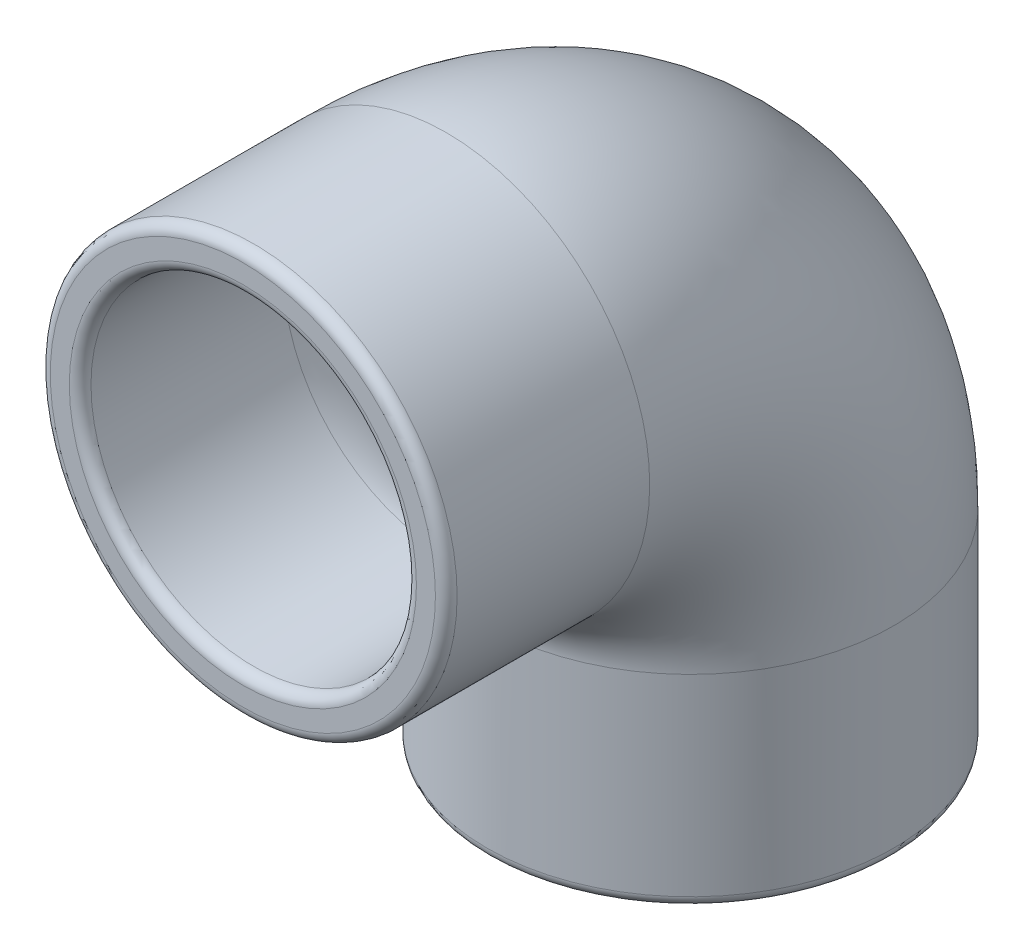
ISO-10303-21;
HEADER;
FILE_DESCRIPTION(('STEP AP214'),'2;1');
FILE_NAME('part.step','',(''),(''),'','','');
FILE_SCHEMA(('AUTOMOTIVE_DESIGN { 1 0 10303 214 1 1 1 1 }'));
ENDSEC;
DATA;
#1=APPLICATION_CONTEXT('core data for automotive mechanical design processes');
#2=APPLICATION_PROTOCOL_DEFINITION('international standard','automotive_design',2000,#1);
#3=PRODUCT_CONTEXT('',#1,'mechanical');
#4=PRODUCT('Part','Part','',(#3));
#5=PRODUCT_RELATED_PRODUCT_CATEGORY('part','',(#4));
#6=PRODUCT_DEFINITION_FORMATION('','',#4);
#7=PRODUCT_DEFINITION_CONTEXT('part definition',#1,'design');
#8=PRODUCT_DEFINITION('design','',#6,#7);
#9=PRODUCT_DEFINITION_SHAPE('','',#8);
#10=(LENGTH_UNIT() NAMED_UNIT(*) SI_UNIT(.MILLI.,.METRE.));
#11=(NAMED_UNIT(*) PLANE_ANGLE_UNIT() SI_UNIT($,.RADIAN.));
#12=(NAMED_UNIT(*) SI_UNIT($,.STERADIAN.) SOLID_ANGLE_UNIT());
#13=UNCERTAINTY_MEASURE_WITH_UNIT(LENGTH_MEASURE(1.E-05),#10,'distance_accuracy_value','');
#14=(GEOMETRIC_REPRESENTATION_CONTEXT(3) GLOBAL_UNCERTAINTY_ASSIGNED_CONTEXT((#13)) GLOBAL_UNIT_ASSIGNED_CONTEXT((#10,
#11,#12)) REPRESENTATION_CONTEXT('',''));
#15=CARTESIAN_POINT('',(0.,0.,0.));
#16=DIRECTION('',(0.,0.,1.));
#17=DIRECTION('',(1.,0.,0.));
#18=AXIS2_PLACEMENT_3D('',#15,#16,#17);
#19=CARTESIAN_POINT('',(0.,-18.,-33.));
#20=DIRECTION('',(0.,-1.,0.));
#21=DIRECTION('',(0.,0.,-1.));
#22=AXIS2_PLACEMENT_3D('',#19,#20,#21);
#23=CYLINDRICAL_SURFACE('',#22,15.);
#24=CARTESIAN_POINT('',(0.,-32.2,-33.));
#25=DIRECTION('',(0.,1.,0.));
#26=DIRECTION('',(0.,0.,1.));
#27=AXIS2_PLACEMENT_3D('',#24,#25,#26);
#28=CIRCLE('',#27,15.);
#29=CARTESIAN_POINT('',(0.,-32.2,-18.));
#30=VERTEX_POINT('',#29);
#31=EDGE_CURVE('E47',#30,#30,#28,.T.);
#32=ORIENTED_EDGE('',*,*,#31,.T.);
#33=EDGE_LOOP('',(#32));
#34=FACE_BOUND('',#33,.T.);
#35=CARTESIAN_POINT('',(0.,-18.,-33.));
#36=DIRECTION('',(0.,1.,0.));
#37=DIRECTION('',(1.,0.,0.));
#38=AXIS2_PLACEMENT_3D('',#35,#36,#37);
#39=CIRCLE('',#38,15.);
#40=CARTESIAN_POINT('',(0.,-18.,-48.));
#41=VERTEX_POINT('',#40);
#42=EDGE_CURVE('E64',#41,#41,#39,.T.);
#43=ORIENTED_EDGE('',*,*,#42,.F.);
#44=EDGE_LOOP('',(#43));
#45=FACE_BOUND('',#44,.T.);
#46=ADVANCED_FACE('F32',(#34,#45),#23,.T.);
#47=CARTESIAN_POINT('',(0.,-18.,-33.));
#48=DIRECTION('',(0.,-1.,0.));
#49=DIRECTION('',(0.,0.,-1.));
#50=AXIS2_PLACEMENT_3D('',#47,#48,#49);
#51=CYLINDRICAL_SURFACE('',#50,12.);
#52=CARTESIAN_POINT('',(0.,-32.2,-33.));
#53=DIRECTION('',(0.,1.,0.));
#54=DIRECTION('',(0.,0.,1.));
#55=AXIS2_PLACEMENT_3D('',#52,#53,#54);
#56=CIRCLE('',#55,12.);
#57=CARTESIAN_POINT('',(0.,-32.2,-21.));
#58=VERTEX_POINT('',#57);
#59=EDGE_CURVE('E10',#58,#58,#56,.F.);
#60=ORIENTED_EDGE('',*,*,#59,.T.);
#61=EDGE_LOOP('',(#60));
#62=FACE_BOUND('',#61,.T.);
#63=CARTESIAN_POINT('',(0.,-18.,-33.));
#64=DIRECTION('',(0.,1.,0.));
#65=DIRECTION('',(1.,0.,0.));
#66=AXIS2_PLACEMENT_3D('',#63,#64,#65);
#67=CIRCLE('',#66,12.);
#68=CARTESIAN_POINT('',(0.,-18.,-45.));
#69=VERTEX_POINT('',#68);
#70=EDGE_CURVE('E67',#69,#69,#67,.T.);
#71=ORIENTED_EDGE('',*,*,#70,.T.);
#72=EDGE_LOOP('',(#71));
#73=FACE_BOUND('',#72,.T.);
#74=ADVANCED_FACE('F95',(#62,#73),#51,.F.);
#75=CARTESIAN_POINT('',(0.,-18.,-15.));
#76=DIRECTION('',(-1.,0.,0.));
#77=DIRECTION('',(0.,0.,1.));
#78=AXIS2_PLACEMENT_3D('',#75,#76,#77);
#79=TOROIDAL_SURFACE('',#78,18.,15.);
#80=CARTESIAN_POINT('',(0.,0.,-15.));
#81=DIRECTION('',(0.,0.,1.));
#82=DIRECTION('',(1.,0.,0.));
#83=AXIS2_PLACEMENT_3D('',#80,#81,#82);
#84=CIRCLE('',#83,15.);
#85=CARTESIAN_POINT('',(0.,15.,-15.));
#86=VERTEX_POINT('',#85);
#87=EDGE_CURVE('E70',#86,#86,#84,.T.);
#88=CARTESIAN_POINT('',(0.,-18.,-15.));
#89=DIRECTION('',(-1.,0.,0.));
#90=DIRECTION('',(0.,0.,1.));
#91=AXIS2_PLACEMENT_3D('',#88,#89,#90);
#92=CIRCLE('',#91,33.);
#93=EDGE_CURVE('',#86,#41,#92,.T.);
#94=ORIENTED_EDGE('',*,*,#87,.F.);
#95=ORIENTED_EDGE('',*,*,#42,.T.);
#96=ORIENTED_EDGE('',*,*,#93,.T.);
#97=ORIENTED_EDGE('',*,*,#93,.F.);
#98=EDGE_LOOP('',(#94,#96,#95,#97));
#99=FACE_BOUND('',#98,.T.);
#100=ADVANCED_FACE('F92',(#99),#79,.T.);
#101=CARTESIAN_POINT('',(0.,-18.,-15.));
#102=DIRECTION('',(-1.,0.,0.));
#103=DIRECTION('',(0.,0.,1.));
#104=AXIS2_PLACEMENT_3D('',#101,#102,#103);
#105=TOROIDAL_SURFACE('',#104,18.,12.);
#106=CARTESIAN_POINT('',(0.,0.,-15.));
#107=DIRECTION('',(0.,0.,1.));
#108=DIRECTION('',(1.,0.,0.));
#109=AXIS2_PLACEMENT_3D('',#106,#107,#108);
#110=CIRCLE('',#109,12.);
#111=CARTESIAN_POINT('',(0.,12.,-15.));
#112=VERTEX_POINT('',#111);
#113=EDGE_CURVE('E73',#112,#112,#110,.T.);
#114=CARTESIAN_POINT('',(0.,-18.,-15.));
#115=DIRECTION('',(-1.,0.,0.));
#116=DIRECTION('',(0.,0.,1.));
#117=AXIS2_PLACEMENT_3D('',#114,#115,#116);
#118=CIRCLE('',#117,30.);
#119=EDGE_CURVE('',#112,#69,#118,.T.);
#120=ORIENTED_EDGE('',*,*,#113,.T.);
#121=ORIENTED_EDGE('',*,*,#70,.F.);
#122=ORIENTED_EDGE('',*,*,#119,.T.);
#123=ORIENTED_EDGE('',*,*,#119,.F.);
#124=EDGE_LOOP('',(#120,#122,#121,#123));
#125=FACE_BOUND('',#124,.T.);
#126=ADVANCED_FACE('F77',(#125),#105,.F.);
#127=CARTESIAN_POINT('',(0.,0.,-15.));
#128=DIRECTION('',(0.,0.,1.));
#129=DIRECTION('',(1.,0.,0.));
#130=AXIS2_PLACEMENT_3D('',#127,#128,#129);
#131=CYLINDRICAL_SURFACE('',#130,12.);
#132=CARTESIAN_POINT('',(0.,0.,-0.8));
#133=DIRECTION('',(0.,0.,1.));
#134=DIRECTION('',(1.,0.,0.));
#135=AXIS2_PLACEMENT_3D('',#132,#133,#134);
#136=CIRCLE('',#135,12.);
#137=CARTESIAN_POINT('',(12.,0.,-0.8));
#138=VERTEX_POINT('',#137);
#139=EDGE_CURVE('E52',#138,#138,#136,.T.);
#140=ORIENTED_EDGE('',*,*,#139,.T.);
#141=EDGE_LOOP('',(#140));
#142=FACE_BOUND('',#141,.T.);
#143=ORIENTED_EDGE('',*,*,#113,.F.);
#144=EDGE_LOOP('',(#143));
#145=FACE_BOUND('',#144,.T.);
#146=ADVANCED_FACE('F80',(#142,#145),#131,.F.);
#147=CARTESIAN_POINT('',(0.,0.,-15.));
#148=DIRECTION('',(0.,0.,1.));
#149=DIRECTION('',(1.,0.,0.));
#150=AXIS2_PLACEMENT_3D('',#147,#148,#149);
#151=CYLINDRICAL_SURFACE('',#150,15.);
#152=CARTESIAN_POINT('',(0.,0.,-0.8));
#153=DIRECTION('',(0.,0.,1.));
#154=DIRECTION('',(1.,0.,0.));
#155=AXIS2_PLACEMENT_3D('',#152,#153,#154);
#156=CIRCLE('',#155,15.);
#157=CARTESIAN_POINT('',(15.,0.,-0.8));
#158=VERTEX_POINT('',#157);
#159=EDGE_CURVE('E55',#158,#158,#156,.F.);
#160=ORIENTED_EDGE('',*,*,#159,.T.);
#161=EDGE_LOOP('',(#160));
#162=FACE_BOUND('',#161,.T.);
#163=ORIENTED_EDGE('',*,*,#87,.T.);
#164=EDGE_LOOP('',(#163));
#165=FACE_BOUND('',#164,.T.);
#166=ADVANCED_FACE('F82',(#162,#165),#151,.T.);
#167=CARTESIAN_POINT('',(0.,-33.,-33.));
#168=DIRECTION('',(0.,1.,0.));
#169=DIRECTION('',(1.,0.,0.));
#170=AXIS2_PLACEMENT_3D('',#167,#168,#169);
#171=PLANE('',#170);
#172=CARTESIAN_POINT('',(0.,-33.,-33.));
#173=DIRECTION('',(0.,1.,0.));
#174=DIRECTION('',(0.,0.,1.));
#175=AXIS2_PLACEMENT_3D('',#172,#173,#174);
#176=CIRCLE('',#175,14.2);
#177=CARTESIAN_POINT('',(0.,-33.,-18.8));
#178=VERTEX_POINT('',#177);
#179=EDGE_CURVE('E39',#178,#178,#176,.F.);
#180=ORIENTED_EDGE('',*,*,#179,.T.);
#181=EDGE_LOOP('',(#180));
#182=FACE_BOUND('',#181,.T.);
#183=CARTESIAN_POINT('',(0.,-33.,-33.));
#184=DIRECTION('',(0.,1.,0.));
#185=DIRECTION('',(0.,0.,1.));
#186=AXIS2_PLACEMENT_3D('',#183,#184,#185);
#187=CIRCLE('',#186,12.8);
#188=CARTESIAN_POINT('',(0.,-33.,-20.2));
#189=VERTEX_POINT('',#188);
#190=EDGE_CURVE('E43',#189,#189,#187,.T.);
#191=ORIENTED_EDGE('',*,*,#190,.T.);
#192=EDGE_LOOP('',(#191));
#193=FACE_BOUND('',#192,.T.);
#194=ADVANCED_FACE('F89',(#182,#193),#171,.F.);
#195=CARTESIAN_POINT('',(0.,0.,0.));
#196=DIRECTION('',(0.,0.,1.));
#197=DIRECTION('',(1.,0.,0.));
#198=AXIS2_PLACEMENT_3D('',#195,#196,#197);
#199=PLANE('',#198);
#200=CARTESIAN_POINT('',(0.,0.,0.));
#201=DIRECTION('',(0.,0.,1.));
#202=DIRECTION('',(1.,0.,0.));
#203=AXIS2_PLACEMENT_3D('',#200,#201,#202);
#204=CIRCLE('',#203,14.2);
#205=CARTESIAN_POINT('',(14.2,0.,0.));
#206=VERTEX_POINT('',#205);
#207=EDGE_CURVE('E58',#206,#206,#204,.T.);
#208=ORIENTED_EDGE('',*,*,#207,.T.);
#209=EDGE_LOOP('',(#208));
#210=FACE_BOUND('',#209,.T.);
#211=CARTESIAN_POINT('',(0.,0.,0.));
#212=DIRECTION('',(0.,0.,1.));
#213=DIRECTION('',(1.,0.,0.));
#214=AXIS2_PLACEMENT_3D('',#211,#212,#213);
#215=CIRCLE('',#214,12.8);
#216=CARTESIAN_POINT('',(12.8,0.,0.));
#217=VERTEX_POINT('',#216);
#218=EDGE_CURVE('E61',#217,#217,#215,.F.);
#219=ORIENTED_EDGE('',*,*,#218,.T.);
#220=EDGE_LOOP('',(#219));
#221=FACE_BOUND('',#220,.T.);
#222=ADVANCED_FACE('F109',(#210,#221),#199,.T.);
#223=CARTESIAN_POINT('',(0.,0.,-0.8));
#224=DIRECTION('',(0.,0.,1.));
#225=DIRECTION('',(1.,0.,0.));
#226=AXIS2_PLACEMENT_3D('',#223,#224,#225);
#227=TOROIDAL_SURFACE('',#226,14.2,0.8);
#228=ORIENTED_EDGE('',*,*,#159,.F.);
#229=EDGE_LOOP('',(#228));
#230=FACE_BOUND('',#229,.T.);
#231=ORIENTED_EDGE('',*,*,#207,.F.);
#232=EDGE_LOOP('',(#231));
#233=FACE_BOUND('',#232,.T.);
#234=ADVANCED_FACE('F105',(#230,#233),#227,.T.);
#235=CARTESIAN_POINT('',(0.,0.,-0.8));
#236=DIRECTION('',(0.,0.,1.));
#237=DIRECTION('',(1.,0.,0.));
#238=AXIS2_PLACEMENT_3D('',#235,#236,#237);
#239=TOROIDAL_SURFACE('',#238,12.8,0.8);
#240=ORIENTED_EDGE('',*,*,#218,.F.);
#241=EDGE_LOOP('',(#240));
#242=FACE_BOUND('',#241,.T.);
#243=ORIENTED_EDGE('',*,*,#139,.F.);
#244=EDGE_LOOP('',(#243));
#245=FACE_BOUND('',#244,.T.);
#246=ADVANCED_FACE('F108',(#242,#245),#239,.T.);
#247=CARTESIAN_POINT('',(0.,-32.2,-33.));
#248=DIRECTION('',(0.,1.,0.));
#249=DIRECTION('',(0.,0.,1.));
#250=AXIS2_PLACEMENT_3D('',#247,#248,#249);
#251=TOROIDAL_SURFACE('',#250,14.2,0.8);
#252=ORIENTED_EDGE('',*,*,#179,.F.);
#253=EDGE_LOOP('',(#252));
#254=FACE_BOUND('',#253,.T.);
#255=ORIENTED_EDGE('',*,*,#31,.F.);
#256=EDGE_LOOP('',(#255));
#257=FACE_BOUND('',#256,.T.);
#258=ADVANCED_FACE('F112',(#254,#257),#251,.T.);
#259=CARTESIAN_POINT('',(0.,-32.2,-33.));
#260=DIRECTION('',(0.,1.,0.));
#261=DIRECTION('',(0.,0.,1.));
#262=AXIS2_PLACEMENT_3D('',#259,#260,#261);
#263=TOROIDAL_SURFACE('',#262,12.8,0.8);
#264=ORIENTED_EDGE('',*,*,#59,.F.);
#265=EDGE_LOOP('',(#264));
#266=FACE_BOUND('',#265,.T.);
#267=ORIENTED_EDGE('',*,*,#190,.F.);
#268=EDGE_LOOP('',(#267));
#269=FACE_BOUND('',#268,.T.);
#270=ADVANCED_FACE('F34',(#266,#269),#263,.T.);
#271=CLOSED_SHELL('',(#46,#74,#100,#126,#146,#166,#194,#222,#234,#246,#258,#270));
#272=MANIFOLD_SOLID_BREP('B2',#271);
#273=ADVANCED_BREP_SHAPE_REPRESENTATION('',(#18,#272),#14);
#274=SHAPE_DEFINITION_REPRESENTATION(#9,#273);
ENDSEC;
END-ISO-10303-21;
